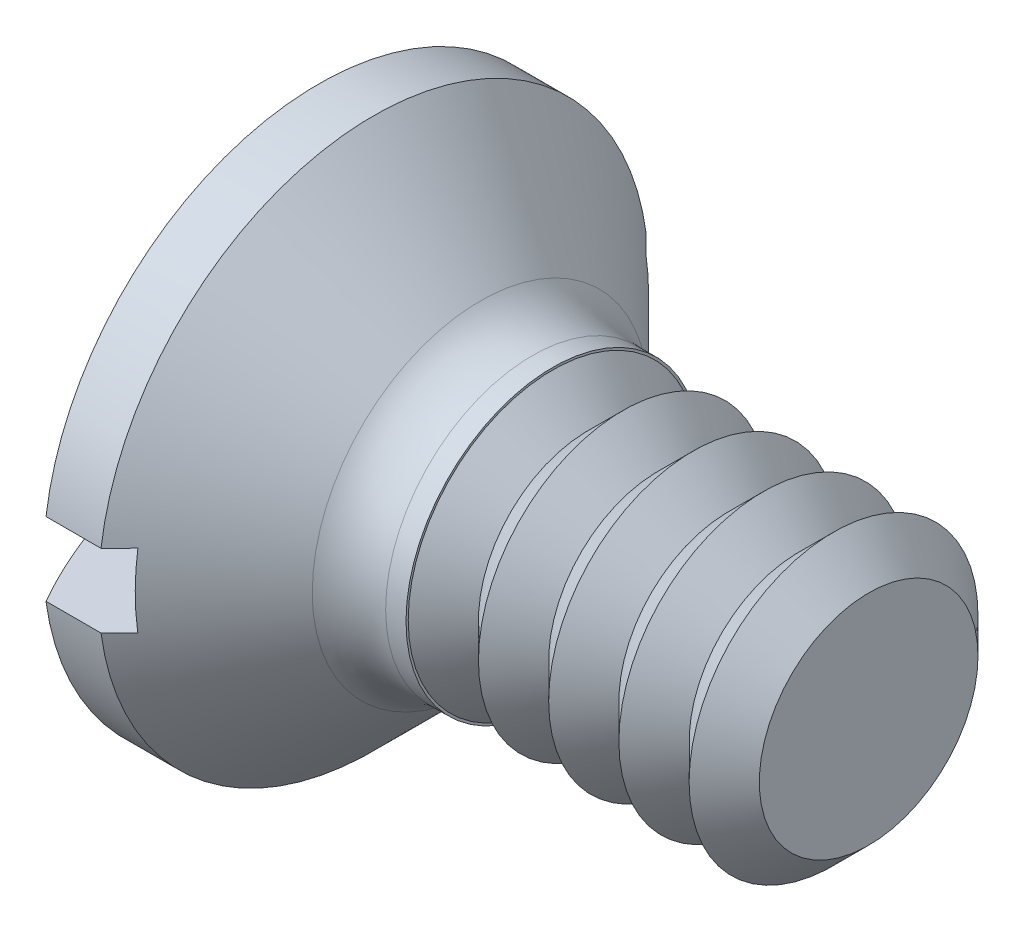
ISO-10303-21;
HEADER;
FILE_DESCRIPTION(('STEP AP214'),'2;1');
FILE_NAME('part.step','',(''),(''),'','','');
FILE_SCHEMA(('AUTOMOTIVE_DESIGN { 1 0 10303 214 1 1 1 1 }'));
ENDSEC;
DATA;
#1=APPLICATION_CONTEXT('core data for automotive mechanical design processes');
#2=APPLICATION_PROTOCOL_DEFINITION('international standard','automotive_design',2000,#1);
#3=PRODUCT_CONTEXT('',#1,'mechanical');
#4=PRODUCT('Part','Part','',(#3));
#5=PRODUCT_RELATED_PRODUCT_CATEGORY('part','',(#4));
#6=PRODUCT_DEFINITION_FORMATION('','',#4);
#7=PRODUCT_DEFINITION_CONTEXT('part definition',#1,'design');
#8=PRODUCT_DEFINITION('design','',#6,#7);
#9=PRODUCT_DEFINITION_SHAPE('','',#8);
#10=(LENGTH_UNIT() NAMED_UNIT(*) SI_UNIT(.MILLI.,.METRE.));
#11=(NAMED_UNIT(*) PLANE_ANGLE_UNIT() SI_UNIT($,.RADIAN.));
#12=(NAMED_UNIT(*) SI_UNIT($,.STERADIAN.) SOLID_ANGLE_UNIT());
#13=UNCERTAINTY_MEASURE_WITH_UNIT(LENGTH_MEASURE(1.E-05),#10,'distance_accuracy_value','');
#14=(GEOMETRIC_REPRESENTATION_CONTEXT(3) GLOBAL_UNCERTAINTY_ASSIGNED_CONTEXT((#13)) GLOBAL_UNIT_ASSIGNED_CONTEXT((#10,
#11,#12)) REPRESENTATION_CONTEXT('',''));
#15=CARTESIAN_POINT('',(0.,0.,0.));
#16=DIRECTION('',(0.,0.,1.));
#17=DIRECTION('',(1.,0.,0.));
#18=AXIS2_PLACEMENT_3D('',#15,#16,#17);
#19=CARTESIAN_POINT('',(3.0125,0.,0.));
#20=DIRECTION('',(-1.,0.,0.));
#21=DIRECTION('',(0.,-1.,0.));
#22=AXIS2_PLACEMENT_3D('',#19,#20,#21);
#23=SPHERICAL_SURFACE('',#22,3.0125);
#24=CARTESIAN_POINT('',(3.0125,0.2,0.));
#25=DIRECTION('',(0.,1.,0.));
#26=DIRECTION('',(0.,0.,1.));
#27=AXIS2_PLACEMENT_3D('',#24,#25,#26);
#28=CIRCLE('',#27,3.00585366410276);
#29=CARTESIAN_POINT('',(0.400000000000001,0.2,1.48660687473185));
#30=VERTEX_POINT('',#29);
#31=CARTESIAN_POINT('',(0.400000000000001,0.2,-1.48660687473185));
#32=VERTEX_POINT('',#31);
#33=EDGE_CURVE('E185',#30,#32,#28,.F.);
#34=ORIENTED_EDGE('',*,*,#33,.F.);
#35=CARTESIAN_POINT('',(0.400000000000001,0.,0.));
#36=DIRECTION('',(-1.,0.,0.));
#37=DIRECTION('',(0.,0.,1.));
#38=AXIS2_PLACEMENT_3D('',#35,#36,#37);
#39=CIRCLE('',#38,1.5);
#40=EDGE_CURVE('E170',#30,#32,#39,.T.);
#41=ORIENTED_EDGE('',*,*,#40,.T.);
#42=EDGE_LOOP('',(#34,#41));
#43=FACE_BOUND('',#42,.T.);
#44=ADVANCED_FACE('F39',(#43),#23,.T.);
#45=CARTESIAN_POINT('',(-15.875,0.,0.));
#46=DIRECTION('',(-1.,0.,0.));
#47=DIRECTION('',(0.,0.,1.));
#48=AXIS2_PLACEMENT_3D('',#45,#46,#47);
#49=CYLINDRICAL_SURFACE('',#48,1.5);
#50=CARTESIAN_POINT('',(0.700000000000006,0.,0.));
#51=DIRECTION('',(-1.,0.,0.));
#52=DIRECTION('',(0.,0.,1.));
#53=AXIS2_PLACEMENT_3D('',#50,#51,#52);
#54=CIRCLE('',#53,1.5);
#55=CARTESIAN_POINT('',(0.700000000000006,0.2,1.48660687473185));
#56=VERTEX_POINT('',#55);
#57=CARTESIAN_POINT('',(0.700000000000006,0.2,-1.48660687473185));
#58=VERTEX_POINT('',#57);
#59=EDGE_CURVE('E111',#56,#58,#54,.T.);
#60=ORIENTED_EDGE('',*,*,#59,.T.);
#61=DIRECTION('',(-1.,0.,0.));
#62=VECTOR('',#61,1.);
#63=CARTESIAN_POINT('',(-15.875,0.2,-1.48660687473185));
#64=LINE('',#63,#62);
#65=EDGE_CURVE('E63',#58,#32,#64,.T.);
#66=ORIENTED_EDGE('',*,*,#65,.T.);
#67=ORIENTED_EDGE('',*,*,#40,.F.);
#68=DIRECTION('',(-1.,0.,0.));
#69=VECTOR('',#68,1.);
#70=CARTESIAN_POINT('',(-15.875,0.2,1.48660687473185));
#71=LINE('',#70,#69);
#72=EDGE_CURVE('E187',#30,#56,#71,.F.);
#73=ORIENTED_EDGE('',*,*,#72,.T.);
#74=EDGE_LOOP('',(#60,#66,#67,#73));
#75=FACE_BOUND('',#74,.T.);
#76=ADVANCED_FACE('F142',(#75),#49,.T.);
#77=CARTESIAN_POINT('',(3.0125,-0.2,0.));
#78=DIRECTION('',(0.,-1.,0.));
#79=DIRECTION('',(0.,0.,-1.));
#80=AXIS2_PLACEMENT_3D('',#77,#78,#79);
#81=CIRCLE('',#80,3.00585366410276);
#82=CARTESIAN_POINT('',(0.400000000000001,-0.2,-1.48660687473185));
#83=VERTEX_POINT('',#82);
#84=CARTESIAN_POINT('',(0.400000000000001,-0.2,1.48660687473185));
#85=VERTEX_POINT('',#84);
#86=EDGE_CURVE('E159',#83,#85,#81,.F.);
#87=ORIENTED_EDGE('',*,*,#86,.F.);
#88=EDGE_CURVE('E161',#83,#85,#39,.T.);
#89=ORIENTED_EDGE('',*,*,#88,.T.);
#90=EDGE_LOOP('',(#87,#89));
#91=FACE_BOUND('',#90,.T.);
#92=ADVANCED_FACE('F145',(#91),#23,.T.);
#93=CARTESIAN_POINT('',(0.700000000000006,-0.2,-1.48660687473185));
#94=VERTEX_POINT('',#93);
#95=CARTESIAN_POINT('',(0.700000000000006,-0.2,1.48660687473185));
#96=VERTEX_POINT('',#95);
#97=EDGE_CURVE('E174',#94,#96,#54,.T.);
#98=ORIENTED_EDGE('',*,*,#97,.T.);
#99=DIRECTION('',(-1.,0.,0.));
#100=VECTOR('',#99,1.);
#101=CARTESIAN_POINT('',(-15.875,-0.2,1.48660687473185));
#102=LINE('',#101,#100);
#103=EDGE_CURVE('E164',#96,#85,#102,.T.);
#104=ORIENTED_EDGE('',*,*,#103,.T.);
#105=ORIENTED_EDGE('',*,*,#88,.F.);
#106=DIRECTION('',(-1.,0.,0.));
#107=VECTOR('',#106,1.);
#108=CARTESIAN_POINT('',(-15.875,-0.2,-1.48660687473185));
#109=LINE('',#108,#107);
#110=EDGE_CURVE('E165',#83,#94,#109,.F.);
#111=ORIENTED_EDGE('',*,*,#110,.T.);
#112=EDGE_LOOP('',(#98,#104,#105,#111));
#113=FACE_BOUND('',#112,.T.);
#114=ADVANCED_FACE('F138',(#113),#49,.T.);
#115=CARTESIAN_POINT('',(0.700000000000006,0.,0.));
#116=DIRECTION('',(-1.,0.,0.));
#117=DIRECTION('',(0.,0.,1.));
#118=AXIS2_PLACEMENT_3D('',#115,#116,#117);
#119=CONICAL_SURFACE('',#118,1.5,0.785398163397453);
#120=CARTESIAN_POINT('',(-1.10119972237643,0.2,-3.29513574940675));
#121=CARTESIAN_POINT('',(-0.988992246037325,0.2,-3.18272013649169));
#122=CARTESIAN_POINT('',(-0.876793782370901,0.2,-3.07029552028468));
#123=CARTESIAN_POINT('',(-0.652424782112992,0.2,-2.84541515431388));
#124=CARTESIAN_POINT('',(-0.540254245952494,0.2,-2.73295940412011));
#125=CARTESIAN_POINT('',(-0.315917477221095,0.2,-2.50797001566592));
#126=CARTESIAN_POINT('',(-0.203751258138119,0.2,-2.39543636395621));
#127=CARTESIAN_POINT('',(0.0205176566286493,0.2,-2.17030894716705));
#128=CARTESIAN_POINT('',(0.132620353192886,0.2,-2.05771518296499));
#129=CARTESIAN_POINT('',(0.359955161990949,0.2,-1.82918154732319));
#130=CARTESIAN_POINT('',(0.475184347650156,0.2,-1.71323876501918));
#131=CARTESIAN_POINT('',(0.705464299303434,0.2,-1.48116620872544));
#132=CARTESIAN_POINT('',(0.820515057596762,0.2,-1.36503642708294));
#133=CARTESIAN_POINT('',(0.992786686969513,0.2,-1.19056513975362));
#134=CARTESIAN_POINT('',(1.05015380741887,0.2,-1.13236806374788));
#135=CARTESIAN_POINT('',(1.16473427196567,0.2,-1.01582050007225));
#136=CARTESIAN_POINT('',(1.22194761344427,0.2,-0.957470009822773));
#137=CARTESIAN_POINT('',(1.33610764913051,0.2,-0.840517869971649));
#138=CARTESIAN_POINT('',(1.39305436379084,0.2,-0.781916240317739));
#139=CARTESIAN_POINT('',(1.50647380386971,0.2,-0.664256543312388));
#140=CARTESIAN_POINT('',(1.56294654683386,0.2,-0.605198493013695));
#141=CARTESIAN_POINT('',(1.6339445668064,0.2,-0.529572863832341));
#142=CARTESIAN_POINT('',(1.64897630195285,0.2,-0.51348180750804));
#143=CARTESIAN_POINT('',(1.67892944243033,0.2,-0.48119708198542));
#144=CARTESIAN_POINT('',(1.69385084606821,0.2,-0.465003411219424));
#145=CARTESIAN_POINT('',(1.73833064028454,0.2,-0.416314330649393));
#146=CARTESIAN_POINT('',(1.76768265617034,0.2,-0.383628306076778));
#147=CARTESIAN_POINT('',(1.81489368291999,0.2,-0.32926587633947));
#148=CARTESIAN_POINT('',(1.83307691949755,0.2,-0.307874109375282));
#149=CARTESIAN_POINT('',(1.86874645077421,0.2,-0.264358898778378));
#150=CARTESIAN_POINT('',(1.88622929531665,0.2,-0.242232629928308));
#151=CARTESIAN_POINT('',(1.91996059737537,0.2,-0.196641656039083));
#152=CARTESIAN_POINT('',(1.93619429387894,0.2,-0.17316540662448));
#153=CARTESIAN_POINT('',(1.95804311910315,0.2,-0.136511734194771));
#154=CARTESIAN_POINT('',(1.96489480184481,0.2,-0.124087439117705));
#155=CARTESIAN_POINT('',(1.97728887761313,0.2,-0.0986136632562632));
#156=CARTESIAN_POINT('',(1.98283402370496,0.2,-0.0855655680293092));
#157=CARTESIAN_POINT('',(1.99190732689225,0.2,-0.0588121805087408));
#158=CARTESIAN_POINT('',(1.99544455227598,0.2,-0.0451101508733778));
#159=CARTESIAN_POINT('',(1.99971270124772,0.2,-0.0173212802573331));
#160=CARTESIAN_POINT('',(2.00045981360995,0.2,-0.00323713825880703));
#161=CARTESIAN_POINT('',(1.99896174164432,0.2,0.0247566734448819));
#162=CARTESIAN_POINT('',(1.99671655766716,0.2,0.0386663431704925));
#163=CARTESIAN_POINT('',(1.98983372747329,0.2,0.0659314563086578));
#164=CARTESIAN_POINT('',(1.98518044873187,0.2,0.079282654625839));
#165=CARTESIAN_POINT('',(1.97273331707033,0.2,0.109005079904587));
#166=CARTESIAN_POINT('',(1.96442212511106,0.2,0.125150312891521));
#167=CARTESIAN_POINT('',(1.9463106035471,0.2,0.156598616785988));
#168=CARTESIAN_POINT('',(1.9365063623954,0.2,0.171899327364714));
#169=CARTESIAN_POINT('',(1.91595070205358,0.2,0.202003422703339));
#170=CARTESIAN_POINT('',(1.90519299324713,0.2,0.21680245293371));
#171=CARTESIAN_POINT('',(1.88313475122272,0.2,0.245953371968504));
#172=CARTESIAN_POINT('',(1.87183497269373,0.2,0.260305839058603));
#173=CARTESIAN_POINT('',(1.83362143131209,0.2,0.307605529609061));
#174=CARTESIAN_POINT('',(1.80591832368196,0.2,0.339910511448321));
#175=CARTESIAN_POINT('',(1.74965425628289,0.2,0.403767953481098));
#176=CARTESIAN_POINT('',(1.72109296297165,0.2,0.43532011230663));
#177=CARTESIAN_POINT('',(1.66345618618843,0.2,0.498028928895668));
#178=CARTESIAN_POINT('',(1.63438007340533,0.2,0.529185009244452));
#179=CARTESIAN_POINT('',(1.57594984960522,0.2,0.591223350720216));
#180=CARTESIAN_POINT('',(1.54659578897832,0.2,0.62210565958636));
#181=CARTESIAN_POINT('',(1.45864705451159,0.2,0.714095316718742));
#182=CARTESIAN_POINT('',(1.39978808358923,0.2,0.77494979229758));
#183=CARTESIAN_POINT('',(1.28177162226279,0.2,0.896288388446726));
#184=CARTESIAN_POINT('',(1.22261435590261,0.2,0.956772728007152));
#185=CARTESIAN_POINT('',(1.07013156622724,0.2,1.11218106887015));
#186=CARTESIAN_POINT('',(0.976664354202431,0.2,1.20696604918554));
#187=CARTESIAN_POINT('',(0.789504370317691,0.2,1.39631403325345));
#188=CARTESIAN_POINT('',(0.695811596658603,0.2,1.49087703522343));
#189=CARTESIAN_POINT('',(0.414489325446591,0.2,1.77443738899108));
#190=CARTESIAN_POINT('',(0.226672416055669,0.2,1.96324879844982));
#191=CARTESIAN_POINT('',(-0.151123937923224,0.2,2.34266348107792));
#192=CARTESIAN_POINT('',(-0.341105385731216,0.2,2.53326475652367));
#193=CARTESIAN_POINT('',(-0.721119410514888,0.2,2.91429430749982));
#194=CARTESIAN_POINT('',(-0.911151951493809,0.2,3.10472261892591));
#195=CARTESIAN_POINT('',(-1.10119972237643,0.2,3.29513574940675));
#196=B_SPLINE_CURVE_WITH_KNOTS('',3,(#120,#121,#122,#123,#124,#125,#126,#127,#128,#129,#130,
#131,#132,#133,#134,#135,#136,#137,#138,#139,#140,#141,#142,#143,#144,#145,#146,#147,#148,#149,
#150,#151,#152,#153,#154,#155,#156,#157,#158,#159,#160,#161,#162,#163,#164,#165,#166,#167,#168,
#169,#170,#171,#172,#173,#174,#175,#176,#177,#178,#179,#180,#181,#182,#183,#184,#185,#186,#187,
#188,#189,#190,#191,#192,#193,#194,#195),.UNSPECIFIED.,.F.,.F.,(4,2,2,2,2,2,2,2,2,2,2,2,2,2,2,2,
2,2,2,2,2,2,2,2,2,2,2,2,2,2,2,2,2,2,2,2,2,4),(0.,0.476497741248008,0.953002429216308,
1.42966346328857,1.90631772064315,2.39670982403613,2.88712253394183,3.13227743664885,
3.37743648819533,3.62257641516278,3.86770722709024,3.9337663438564,3.99982647227454,
4.13160595863709,4.21581896093897,4.30040560188256,4.38587366078667,4.42839152267739,
4.47081897551919,4.513053258602,4.55504210606938,4.59703094861571,4.63929585262983,
4.69362695191335,4.74810291965479,4.80296964049984,4.85776207349177,4.98538697714486,
5.11306214197101,5.24090593849605,5.36872698539848,5.62270906330816,5.87652258054365,
6.27587440091319,6.67522941727534,7.47418092133959,8.28151988458991,9.0885996527683),.UNSPECIFIED.);
#197=CARTESIAN_POINT('',(0.8,0.2,-1.38564064605511));
#198=VERTEX_POINT('',#197);
#199=EDGE_CURVE('E11',#58,#198,#196,.T.);
#200=ORIENTED_EDGE('',*,*,#199,.F.);
#201=ORIENTED_EDGE('',*,*,#59,.F.);
#202=CARTESIAN_POINT('',(0.8,0.2,1.38564064605511));
#203=VERTEX_POINT('',#202);
#204=EDGE_CURVE('E49',#203,#56,#196,.T.);
#205=ORIENTED_EDGE('',*,*,#204,.F.);
#206=CARTESIAN_POINT('',(0.8,0.,0.));
#207=DIRECTION('',(-1.,0.,0.));
#208=DIRECTION('',(0.,0.,1.));
#209=AXIS2_PLACEMENT_3D('',#206,#207,#208);
#210=CIRCLE('',#209,1.4);
#211=CARTESIAN_POINT('',(0.8,-0.2,1.38564064605511));
#212=VERTEX_POINT('',#211);
#213=EDGE_CURVE('E92',#203,#212,#210,.F.);
#214=ORIENTED_EDGE('',*,*,#213,.T.);
#215=CARTESIAN_POINT('',(-1.10119972237643,-0.2,3.29513574940675));
#216=CARTESIAN_POINT('',(-0.988992246037325,-0.2,3.18272013649169));
#217=CARTESIAN_POINT('',(-0.876793782370901,-0.2,3.07029552028468));
#218=CARTESIAN_POINT('',(-0.652424782112992,-0.2,2.84541515431388));
#219=CARTESIAN_POINT('',(-0.540254245952494,-0.2,2.73295940412011));
#220=CARTESIAN_POINT('',(-0.315917477221095,-0.2,2.50797001566592));
#221=CARTESIAN_POINT('',(-0.203751258138119,-0.2,2.39543636395621));
#222=CARTESIAN_POINT('',(0.0205176566286492,-0.2,2.17030894716705));
#223=CARTESIAN_POINT('',(0.132620353192886,-0.2,2.05771518296499));
#224=CARTESIAN_POINT('',(0.359955161990949,-0.2,1.82918154732319));
#225=CARTESIAN_POINT('',(0.475184347650157,-0.2,1.71323876501918));
#226=CARTESIAN_POINT('',(0.705464299303434,-0.2,1.48116620872543));
#227=CARTESIAN_POINT('',(0.820515057596761,-0.2,1.36503642708294));
#228=CARTESIAN_POINT('',(0.992786686969513,-0.2,1.19056513975362));
#229=CARTESIAN_POINT('',(1.05015380741887,-0.2,1.13236806374788));
#230=CARTESIAN_POINT('',(1.16473427196567,-0.2,1.01582050007225));
#231=CARTESIAN_POINT('',(1.22194761344427,-0.2,0.957470009822773));
#232=CARTESIAN_POINT('',(1.33610764913051,-0.2,0.840517869971649));
#233=CARTESIAN_POINT('',(1.39305436379084,-0.2,0.781916240317739));
#234=CARTESIAN_POINT('',(1.50647380386971,-0.2,0.664256543312388));
#235=CARTESIAN_POINT('',(1.56294654683386,-0.2,0.605198493013695));
#236=CARTESIAN_POINT('',(1.6339445668064,-0.2,0.529572863832341));
#237=CARTESIAN_POINT('',(1.64897630195285,-0.2,0.51348180750804));
#238=CARTESIAN_POINT('',(1.67892944243033,-0.2,0.48119708198542));
#239=CARTESIAN_POINT('',(1.69385084606821,-0.2,0.465003411219424));
#240=CARTESIAN_POINT('',(1.73833064028454,-0.2,0.416314330649393));
#241=CARTESIAN_POINT('',(1.76768265617034,-0.2,0.383628306076778));
#242=CARTESIAN_POINT('',(1.81489368291999,-0.2,0.32926587633947));
#243=CARTESIAN_POINT('',(1.83307691949755,-0.2,0.307874109375283));
#244=CARTESIAN_POINT('',(1.86874645077421,-0.2,0.264358898778378));
#245=CARTESIAN_POINT('',(1.88622929531665,-0.2,0.242232629928308));
#246=CARTESIAN_POINT('',(1.91996059737537,-0.2,0.196641656039083));
#247=CARTESIAN_POINT('',(1.93619429387894,-0.2,0.17316540662448));
#248=CARTESIAN_POINT('',(1.95804311910315,-0.2,0.136511734194771));
#249=CARTESIAN_POINT('',(1.96489480184481,-0.2,0.124087439117705));
#250=CARTESIAN_POINT('',(1.97728887761313,-0.2,0.0986136632562631));
#251=CARTESIAN_POINT('',(1.98283402370496,-0.2,0.0855655680293093));
#252=CARTESIAN_POINT('',(1.99190732689225,-0.2,0.0588121805087413));
#253=CARTESIAN_POINT('',(1.99544455227598,-0.2,0.0451101508733785));
#254=CARTESIAN_POINT('',(1.99971270124772,-0.2,0.0173212802573338));
#255=CARTESIAN_POINT('',(2.00045981360995,-0.2,0.00323713825880744));
#256=CARTESIAN_POINT('',(1.99896174164432,-0.2,-0.0247566734448821));
#257=CARTESIAN_POINT('',(1.99671655766716,-0.2,-0.038666343170493));
#258=CARTESIAN_POINT('',(1.98983372747329,-0.2,-0.0659314563086582));
#259=CARTESIAN_POINT('',(1.98518044873187,-0.2,-0.0792826546258391));
#260=CARTESIAN_POINT('',(1.97273331707033,-0.2,-0.109005079904587));
#261=CARTESIAN_POINT('',(1.96442212511106,-0.2,-0.12515031289152));
#262=CARTESIAN_POINT('',(1.9463106035471,-0.2,-0.156598616785987));
#263=CARTESIAN_POINT('',(1.9365063623954,-0.2,-0.171899327364714));
#264=CARTESIAN_POINT('',(1.91595070205358,-0.2,-0.202003422703338));
#265=CARTESIAN_POINT('',(1.90519299324713,-0.2,-0.21680245293371));
#266=CARTESIAN_POINT('',(1.88313475122272,-0.2,-0.245953371968504));
#267=CARTESIAN_POINT('',(1.87183497269373,-0.2,-0.260305839058603));
#268=CARTESIAN_POINT('',(1.83362143131209,-0.2,-0.30760552960906));
#269=CARTESIAN_POINT('',(1.80591832368196,-0.2,-0.33991051144832));
#270=CARTESIAN_POINT('',(1.74965425628289,-0.2,-0.403767953481097));
#271=CARTESIAN_POINT('',(1.72109296297165,-0.2,-0.43532011230663));
#272=CARTESIAN_POINT('',(1.66345618618843,-0.2,-0.498028928895667));
#273=CARTESIAN_POINT('',(1.63438007340533,-0.2,-0.529185009244451));
#274=CARTESIAN_POINT('',(1.57594984960522,-0.2,-0.591223350720215));
#275=CARTESIAN_POINT('',(1.54659578897832,-0.2,-0.622105659586358));
#276=CARTESIAN_POINT('',(1.45864705451159,-0.2,-0.714095316718741));
#277=CARTESIAN_POINT('',(1.39978808358923,-0.2,-0.774949792297579));
#278=CARTESIAN_POINT('',(1.28177162226279,-0.2,-0.896288388446724));
#279=CARTESIAN_POINT('',(1.22261435590261,-0.2,-0.956772728007151));
#280=CARTESIAN_POINT('',(1.07013156622724,-0.2,-1.11218106887015));
#281=CARTESIAN_POINT('',(0.976664354202432,-0.2,-1.20696604918554));
#282=CARTESIAN_POINT('',(0.789504370317692,-0.2,-1.39631403325345));
#283=CARTESIAN_POINT('',(0.695811596658604,-0.2,-1.49087703522343));
#284=CARTESIAN_POINT('',(0.414489325446591,-0.2,-1.77443738899108));
#285=CARTESIAN_POINT('',(0.226672416055669,-0.2,-1.96324879844982));
#286=CARTESIAN_POINT('',(-0.151123937923223,-0.2,-2.34266348107792));
#287=CARTESIAN_POINT('',(-0.341105385731215,-0.2,-2.53326475652367));
#288=CARTESIAN_POINT('',(-0.721119410514887,-0.2,-2.91429430749982));
#289=CARTESIAN_POINT('',(-0.911151951493809,-0.2,-3.10472261892591));
#290=CARTESIAN_POINT('',(-1.10119972237643,-0.2,-3.29513574940675));
#291=B_SPLINE_CURVE_WITH_KNOTS('',3,(#215,#216,#217,#218,#219,#220,#221,#222,#223,#224,#225,
#226,#227,#228,#229,#230,#231,#232,#233,#234,#235,#236,#237,#238,#239,#240,#241,#242,#243,#244,
#245,#246,#247,#248,#249,#250,#251,#252,#253,#254,#255,#256,#257,#258,#259,#260,#261,#262,#263,
#264,#265,#266,#267,#268,#269,#270,#271,#272,#273,#274,#275,#276,#277,#278,#279,#280,#281,#282,
#283,#284,#285,#286,#287,#288,#289,#290),.UNSPECIFIED.,.F.,.F.,(4,2,2,2,2,2,2,2,2,2,2,2,2,2,2,2,
2,2,2,2,2,2,2,2,2,2,2,2,2,2,2,2,2,2,2,2,2,4),(0.,0.476497741248008,0.953002429216308,
1.42966346328857,1.90631772064315,2.39670982403613,2.88712253394183,3.13227743664885,
3.37743648819533,3.62257641516278,3.86770722709024,3.9337663438564,3.99982647227454,
4.13160595863709,4.21581896093897,4.30040560188256,4.38587366078667,4.42839152267739,
4.47081897551919,4.513053258602,4.55504210606938,4.59703094861571,4.63929585262983,
4.69362695191335,4.74810291965479,4.80296964049984,4.85776207349177,4.98538697714486,
5.11306214197101,5.24090593849605,5.36872698539848,5.62270906330816,5.87652258054365,
6.27587440091319,6.67522941727534,7.47418092133959,8.28151988458991,9.0885996527683),.UNSPECIFIED.);
#292=EDGE_CURVE('E100',#96,#212,#291,.T.);
#293=ORIENTED_EDGE('',*,*,#292,.F.);
#294=ORIENTED_EDGE('',*,*,#97,.F.);
#295=CARTESIAN_POINT('',(0.8,-0.2,-1.38564064605511));
#296=VERTEX_POINT('',#295);
#297=EDGE_CURVE('E48',#296,#94,#291,.T.);
#298=ORIENTED_EDGE('',*,*,#297,.F.);
#299=EDGE_CURVE('E103',#296,#198,#210,.F.);
#300=ORIENTED_EDGE('',*,*,#299,.T.);
#301=EDGE_LOOP('',(#200,#201,#205,#214,#293,#294,#298,#300));
#302=FACE_BOUND('',#301,.T.);
#303=CARTESIAN_POINT('',(1.28284271247462,0.,0.));
#304=DIRECTION('',(1.,0.,0.));
#305=DIRECTION('',(0.,0.,-1.));
#306=AXIS2_PLACEMENT_3D('',#303,#304,#305);
#307=CIRCLE('',#306,0.917157287525383);
#308=CARTESIAN_POINT('',(1.28284271247462,0.,-0.917157287525383));
#309=VERTEX_POINT('',#308);
#310=EDGE_CURVE('E173',#309,#309,#307,.F.);
#311=ORIENTED_EDGE('',*,*,#310,.T.);
#312=EDGE_LOOP('',(#311));
#313=FACE_BOUND('',#312,.T.);
#314=ADVANCED_FACE('F108',(#302,#313),#119,.T.);
#315=CARTESIAN_POINT('',(-15.875,0.,0.));
#316=DIRECTION('',(-1.,0.,0.));
#317=DIRECTION('',(0.,0.,1.));
#318=AXIS2_PLACEMENT_3D('',#315,#316,#317);
#319=CYLINDRICAL_SURFACE('',#318,0.8);
#320=CARTESIAN_POINT('',(1.67671519683472,0.,0.));
#321=DIRECTION('',(-1.,0.,0.));
#322=DIRECTION('',(0.,0.,1.));
#323=AXIS2_PLACEMENT_3D('',#320,#321,#322);
#324=CIRCLE('',#323,0.8);
#325=CARTESIAN_POINT('',(1.67671519683472,0.,0.8));
#326=VERTEX_POINT('',#325);
#327=EDGE_CURVE('E43',#326,#326,#324,.T.);
#328=ORIENTED_EDGE('',*,*,#327,.T.);
#329=EDGE_LOOP('',(#328));
#330=FACE_BOUND('',#329,.T.);
#331=CARTESIAN_POINT('',(1.56568542494924,0.,0.));
#332=DIRECTION('',(-1.,0.,0.));
#333=DIRECTION('',(0.,0.,1.));
#334=AXIS2_PLACEMENT_3D('',#331,#332,#333);
#335=CIRCLE('',#334,0.8);
#336=CARTESIAN_POINT('',(1.56568542494924,0.,0.8));
#337=VERTEX_POINT('',#336);
#338=EDGE_CURVE('E101',#337,#337,#335,.F.);
#339=ORIENTED_EDGE('',*,*,#338,.T.);
#340=EDGE_LOOP('',(#339));
#341=FACE_BOUND('',#340,.T.);
#342=ADVANCED_FACE('F130',(#330,#341),#319,.T.);
#343=CARTESIAN_POINT('',(1.56568542494924,0.,0.));
#344=DIRECTION('',(-1.,0.,0.));
#345=DIRECTION('',(0.,0.,1.));
#346=AXIS2_PLACEMENT_3D('',#343,#344,#345);
#347=TOROIDAL_SURFACE('',#346,1.2,0.4);
#348=ORIENTED_EDGE('',*,*,#338,.F.);
#349=EDGE_LOOP('',(#348));
#350=FACE_BOUND('',#349,.T.);
#351=ORIENTED_EDGE('',*,*,#310,.F.);
#352=EDGE_LOOP('',(#351));
#353=FACE_BOUND('',#352,.T.);
#354=ADVANCED_FACE('F41',(#350,#353),#347,.F.);
#355=CARTESIAN_POINT('',(0.8,0.2,1.5));
#356=DIRECTION('',(0.,1.,0.));
#357=DIRECTION('',(0.,0.,1.));
#358=AXIS2_PLACEMENT_3D('',#355,#356,#357);
#359=PLANE('',#358);
#360=ORIENTED_EDGE('',*,*,#199,.T.);
#361=DIRECTION('',(0.,0.,-1.));
#362=VECTOR('',#361,1.);
#363=CARTESIAN_POINT('',(0.8,0.2,1.5));
#364=LINE('',#363,#362);
#365=EDGE_CURVE('E95',#203,#198,#364,.T.);
#366=ORIENTED_EDGE('',*,*,#365,.F.);
#367=ORIENTED_EDGE('',*,*,#204,.T.);
#368=ORIENTED_EDGE('',*,*,#72,.F.);
#369=ORIENTED_EDGE('',*,*,#33,.T.);
#370=ORIENTED_EDGE('',*,*,#65,.F.);
#371=EDGE_LOOP('',(#360,#366,#367,#368,#369,#370));
#372=FACE_BOUND('',#371,.T.);
#373=ADVANCED_FACE('F104',(#372),#359,.F.);
#374=CARTESIAN_POINT('',(0.8,-0.2,-1.5));
#375=DIRECTION('',(0.,-1.,0.));
#376=DIRECTION('',(0.,0.,-1.));
#377=AXIS2_PLACEMENT_3D('',#374,#375,#376);
#378=PLANE('',#377);
#379=ORIENTED_EDGE('',*,*,#292,.T.);
#380=DIRECTION('',(0.,0.,1.));
#381=VECTOR('',#380,1.);
#382=CARTESIAN_POINT('',(0.8,-0.2,-1.5));
#383=LINE('',#382,#381);
#384=EDGE_CURVE('E56',#296,#212,#383,.T.);
#385=ORIENTED_EDGE('',*,*,#384,.F.);
#386=ORIENTED_EDGE('',*,*,#297,.T.);
#387=ORIENTED_EDGE('',*,*,#110,.F.);
#388=ORIENTED_EDGE('',*,*,#86,.T.);
#389=ORIENTED_EDGE('',*,*,#103,.F.);
#390=EDGE_LOOP('',(#379,#385,#386,#387,#388,#389));
#391=FACE_BOUND('',#390,.T.);
#392=ADVANCED_FACE('F127',(#391),#378,.F.);
#393=CARTESIAN_POINT('',(0.8,0.2,-1.5));
#394=DIRECTION('',(-1.,0.,0.));
#395=DIRECTION('',(0.,0.,1.));
#396=AXIS2_PLACEMENT_3D('',#393,#394,#395);
#397=PLANE('',#396);
#398=ORIENTED_EDGE('',*,*,#384,.T.);
#399=ORIENTED_EDGE('',*,*,#213,.F.);
#400=ORIENTED_EDGE('',*,*,#365,.T.);
#401=ORIENTED_EDGE('',*,*,#299,.F.);
#402=EDGE_LOOP('',(#398,#399,#400,#401));
#403=FACE_BOUND('',#402,.T.);
#404=ADVANCED_FACE('F94',(#403),#397,.T.);
#405=CARTESIAN_POINT('',(1.67671519683472,0.,-0.787812572289908));
#406=DIRECTION('',(-1.,0.,0.));
#407=DIRECTION('',(0.,0.,1.));
#408=AXIS2_PLACEMENT_3D('',#405,#406,#407);
#409=PLANE('',#408);
#410=CARTESIAN_POINT('',(1.67671519683472,0.,0.));
#411=DIRECTION('',(1.,0.,0.));
#412=DIRECTION('',(0.,0.,-1.));
#413=AXIS2_PLACEMENT_3D('',#410,#411,#412);
#414=CIRCLE('',#413,0.787812572289908);
#415=CARTESIAN_POINT('',(1.67671519683472,0.,-0.787812572289908));
#416=VERTEX_POINT('',#415);
#417=EDGE_CURVE('E219',#416,#416,#414,.T.);
#418=ORIENTED_EDGE('',*,*,#417,.F.);
#419=EDGE_LOOP('',(#418));
#420=FACE_BOUND('',#419,.T.);
#421=ORIENTED_EDGE('',*,*,#327,.F.);
#422=EDGE_LOOP('',(#421));
#423=FACE_BOUND('',#422,.T.);
#424=ADVANCED_FACE('F225',(#420,#423),#409,.F.);
#425=CARTESIAN_POINT('',(3.20852391075941,0.,0.));
#426=DIRECTION('',(-1.,0.,0.));
#427=DIRECTION('',(0.,0.,1.));
#428=AXIS2_PLACEMENT_3D('',#425,#426,#427);
#429=CONICAL_SURFACE('',#428,0.787812572289906,0.785398163397448);
#430=CARTESIAN_POINT('',(3.4,0.,0.));
#431=DIRECTION('',(1.,0.,0.));
#432=DIRECTION('',(0.,0.,-1.));
#433=AXIS2_PLACEMENT_3D('',#430,#431,#432);
#434=CIRCLE('',#433,0.596336483049314);
#435=CARTESIAN_POINT('',(3.4,0.,-0.596336483049314));
#436=VERTEX_POINT('',#435);
#437=EDGE_CURVE('E192',#436,#436,#434,.T.);
#438=ORIENTED_EDGE('',*,*,#437,.F.);
#439=EDGE_LOOP('',(#438));
#440=FACE_BOUND('',#439,.T.);
#441=CARTESIAN_POINT('',(3.20852391075941,0.,0.));
#442=DIRECTION('',(1.,0.,0.));
#443=DIRECTION('',(0.,0.,-1.));
#444=AXIS2_PLACEMENT_3D('',#441,#442,#443);
#445=CIRCLE('',#444,0.787812572289906);
#446=CARTESIAN_POINT('',(3.20852391075941,0.,-0.787812572289906));
#447=VERTEX_POINT('',#446);
#448=EDGE_CURVE('E195',#447,#447,#445,.T.);
#449=ORIENTED_EDGE('',*,*,#448,.T.);
#450=EDGE_LOOP('',(#449));
#451=FACE_BOUND('',#450,.T.);
#452=ADVANCED_FACE('F228',(#440,#451),#429,.T.);
#453=CARTESIAN_POINT('',(3.01704782151883,0.,0.));
#454=DIRECTION('',(1.,0.,0.));
#455=DIRECTION('',(0.,0.,-1.));
#456=AXIS2_PLACEMENT_3D('',#453,#454,#455);
#457=CONICAL_SURFACE('',#456,0.596336483049322,0.785398163397449);
#458=ORIENTED_EDGE('',*,*,#448,.F.);
#459=EDGE_LOOP('',(#458));
#460=FACE_BOUND('',#459,.T.);
#461=CARTESIAN_POINT('',(3.01704782151883,0.,0.));
#462=DIRECTION('',(1.,0.,0.));
#463=DIRECTION('',(0.,0.,-1.));
#464=AXIS2_PLACEMENT_3D('',#461,#462,#463);
#465=CIRCLE('',#464,0.596336483049322);
#466=CARTESIAN_POINT('',(3.01704782151883,0.,-0.596336483049322));
#467=VERTEX_POINT('',#466);
#468=EDGE_CURVE('E198',#467,#467,#465,.T.);
#469=ORIENTED_EDGE('',*,*,#468,.T.);
#470=EDGE_LOOP('',(#469));
#471=FACE_BOUND('',#470,.T.);
#472=ADVANCED_FACE('F235',(#460,#471),#457,.T.);
#473=CARTESIAN_POINT('',(2.82557173227824,0.,0.));
#474=DIRECTION('',(-1.,0.,0.));
#475=DIRECTION('',(0.,0.,1.));
#476=AXIS2_PLACEMENT_3D('',#473,#474,#475);
#477=CONICAL_SURFACE('',#476,0.787812572289908,0.785398163397437);
#478=ORIENTED_EDGE('',*,*,#468,.F.);
#479=EDGE_LOOP('',(#478));
#480=FACE_BOUND('',#479,.T.);
#481=CARTESIAN_POINT('',(2.82557173227824,0.,0.));
#482=DIRECTION('',(1.,0.,0.));
#483=DIRECTION('',(0.,0.,-1.));
#484=AXIS2_PLACEMENT_3D('',#481,#482,#483);
#485=CIRCLE('',#484,0.787812572289908);
#486=CARTESIAN_POINT('',(2.82557173227824,0.,-0.787812572289908));
#487=VERTEX_POINT('',#486);
#488=EDGE_CURVE('E201',#487,#487,#485,.T.);
#489=ORIENTED_EDGE('',*,*,#488,.T.);
#490=EDGE_LOOP('',(#489));
#491=FACE_BOUND('',#490,.T.);
#492=ADVANCED_FACE('F241',(#480,#491),#477,.T.);
#493=CARTESIAN_POINT('',(2.63409564303766,0.,0.));
#494=DIRECTION('',(1.,0.,0.));
#495=DIRECTION('',(0.,0.,-1.));
#496=AXIS2_PLACEMENT_3D('',#493,#494,#495);
#497=CONICAL_SURFACE('',#496,0.596336483049322,0.78539816339746);
#498=ORIENTED_EDGE('',*,*,#488,.F.);
#499=EDGE_LOOP('',(#498));
#500=FACE_BOUND('',#499,.T.);
#501=CARTESIAN_POINT('',(2.63409564303766,0.,0.));
#502=DIRECTION('',(1.,0.,0.));
#503=DIRECTION('',(0.,0.,-1.));
#504=AXIS2_PLACEMENT_3D('',#501,#502,#503);
#505=CIRCLE('',#504,0.596336483049322);
#506=CARTESIAN_POINT('',(2.63409564303766,0.,-0.596336483049322));
#507=VERTEX_POINT('',#506);
#508=EDGE_CURVE('E204',#507,#507,#505,.T.);
#509=ORIENTED_EDGE('',*,*,#508,.T.);
#510=EDGE_LOOP('',(#509));
#511=FACE_BOUND('',#510,.T.);
#512=ADVANCED_FACE('F245',(#500,#511),#497,.T.);
#513=CARTESIAN_POINT('',(2.44261955379707,0.,0.));
#514=DIRECTION('',(-1.,0.,0.));
#515=DIRECTION('',(0.,0.,1.));
#516=AXIS2_PLACEMENT_3D('',#513,#514,#515);
#517=CONICAL_SURFACE('',#516,0.787812572289908,0.785398163397437);
#518=ORIENTED_EDGE('',*,*,#508,.F.);
#519=EDGE_LOOP('',(#518));
#520=FACE_BOUND('',#519,.T.);
#521=CARTESIAN_POINT('',(2.44261955379707,0.,0.));
#522=DIRECTION('',(1.,0.,0.));
#523=DIRECTION('',(0.,0.,-1.));
#524=AXIS2_PLACEMENT_3D('',#521,#522,#523);
#525=CIRCLE('',#524,0.787812572289908);
#526=CARTESIAN_POINT('',(2.44261955379707,0.,-0.787812572289908));
#527=VERTEX_POINT('',#526);
#528=EDGE_CURVE('E207',#527,#527,#525,.T.);
#529=ORIENTED_EDGE('',*,*,#528,.T.);
#530=EDGE_LOOP('',(#529));
#531=FACE_BOUND('',#530,.T.);
#532=ADVANCED_FACE('F249',(#520,#531),#517,.T.);
#533=CARTESIAN_POINT('',(2.25114346455649,0.,0.));
#534=DIRECTION('',(1.,0.,0.));
#535=DIRECTION('',(0.,0.,-1.));
#536=AXIS2_PLACEMENT_3D('',#533,#534,#535);
#537=CONICAL_SURFACE('',#536,0.596336483049322,0.78539816339746);
#538=ORIENTED_EDGE('',*,*,#528,.F.);
#539=EDGE_LOOP('',(#538));
#540=FACE_BOUND('',#539,.T.);
#541=CARTESIAN_POINT('',(2.25114346455649,0.,0.));
#542=DIRECTION('',(1.,0.,0.));
#543=DIRECTION('',(0.,0.,-1.));
#544=AXIS2_PLACEMENT_3D('',#541,#542,#543);
#545=CIRCLE('',#544,0.596336483049322);
#546=CARTESIAN_POINT('',(2.25114346455649,0.,-0.596336483049322));
#547=VERTEX_POINT('',#546);
#548=EDGE_CURVE('E210',#547,#547,#545,.T.);
#549=ORIENTED_EDGE('',*,*,#548,.T.);
#550=EDGE_LOOP('',(#549));
#551=FACE_BOUND('',#550,.T.);
#552=ADVANCED_FACE('F253',(#540,#551),#537,.T.);
#553=CARTESIAN_POINT('',(2.0596673753159,0.,0.));
#554=DIRECTION('',(-1.,0.,0.));
#555=DIRECTION('',(0.,0.,1.));
#556=AXIS2_PLACEMENT_3D('',#553,#554,#555);
#557=CONICAL_SURFACE('',#556,0.787812572289908,0.785398163397436);
#558=ORIENTED_EDGE('',*,*,#548,.F.);
#559=EDGE_LOOP('',(#558));
#560=FACE_BOUND('',#559,.T.);
#561=CARTESIAN_POINT('',(2.0596673753159,0.,0.));
#562=DIRECTION('',(1.,0.,0.));
#563=DIRECTION('',(0.,0.,-1.));
#564=AXIS2_PLACEMENT_3D('',#561,#562,#563);
#565=CIRCLE('',#564,0.787812572289908);
#566=CARTESIAN_POINT('',(2.0596673753159,0.,-0.787812572289908));
#567=VERTEX_POINT('',#566);
#568=EDGE_CURVE('E213',#567,#567,#565,.T.);
#569=ORIENTED_EDGE('',*,*,#568,.T.);
#570=EDGE_LOOP('',(#569));
#571=FACE_BOUND('',#570,.T.);
#572=ADVANCED_FACE('F257',(#560,#571),#557,.T.);
#573=CARTESIAN_POINT('',(1.86819128607531,0.,0.));
#574=DIRECTION('',(1.,0.,0.));
#575=DIRECTION('',(0.,0.,-1.));
#576=AXIS2_PLACEMENT_3D('',#573,#574,#575);
#577=CONICAL_SURFACE('',#576,0.596336483049322,0.78539816339746);
#578=ORIENTED_EDGE('',*,*,#568,.F.);
#579=EDGE_LOOP('',(#578));
#580=FACE_BOUND('',#579,.T.);
#581=CARTESIAN_POINT('',(1.86819128607531,0.,0.));
#582=DIRECTION('',(1.,0.,0.));
#583=DIRECTION('',(0.,0.,-1.));
#584=AXIS2_PLACEMENT_3D('',#581,#582,#583);
#585=CIRCLE('',#584,0.596336483049322);
#586=CARTESIAN_POINT('',(1.86819128607531,0.,-0.596336483049322));
#587=VERTEX_POINT('',#586);
#588=EDGE_CURVE('E216',#587,#587,#585,.T.);
#589=ORIENTED_EDGE('',*,*,#588,.T.);
#590=EDGE_LOOP('',(#589));
#591=FACE_BOUND('',#590,.T.);
#592=ADVANCED_FACE('F261',(#580,#591),#577,.T.);
#593=CARTESIAN_POINT('',(1.67671519683472,0.,0.));
#594=DIRECTION('',(-1.,0.,0.));
#595=DIRECTION('',(0.,0.,1.));
#596=AXIS2_PLACEMENT_3D('',#593,#594,#595);
#597=CONICAL_SURFACE('',#596,0.787812572289908,0.785398163397436);
#598=ORIENTED_EDGE('',*,*,#588,.F.);
#599=EDGE_LOOP('',(#598));
#600=FACE_BOUND('',#599,.T.);
#601=ORIENTED_EDGE('',*,*,#417,.T.);
#602=EDGE_LOOP('',(#601));
#603=FACE_BOUND('',#602,.T.);
#604=ADVANCED_FACE('F223',(#600,#603),#597,.T.);
#605=CARTESIAN_POINT('',(3.4,0.,0.));
#606=DIRECTION('',(-1.,0.,0.));
#607=DIRECTION('',(0.,0.,1.));
#608=AXIS2_PLACEMENT_3D('',#605,#606,#607);
#609=PLANE('',#608);
#610=ORIENTED_EDGE('',*,*,#437,.T.);
#611=EDGE_LOOP('',(#610));
#612=FACE_BOUND('',#611,.T.);
#613=ADVANCED_FACE('F267',(#612),#609,.F.);
#614=CLOSED_SHELL('',(#44,#76,#92,#114,#314,#342,#354,#373,#392,#404,#424,#452,#472,#492,#512,
#532,#552,#572,#592,#604,#613));
#615=MANIFOLD_SOLID_BREP('B2',#614);
#616=ADVANCED_BREP_SHAPE_REPRESENTATION('',(#18,#615),#14);
#617=SHAPE_DEFINITION_REPRESENTATION(#9,#616);
ENDSEC;
END-ISO-10303-21;
